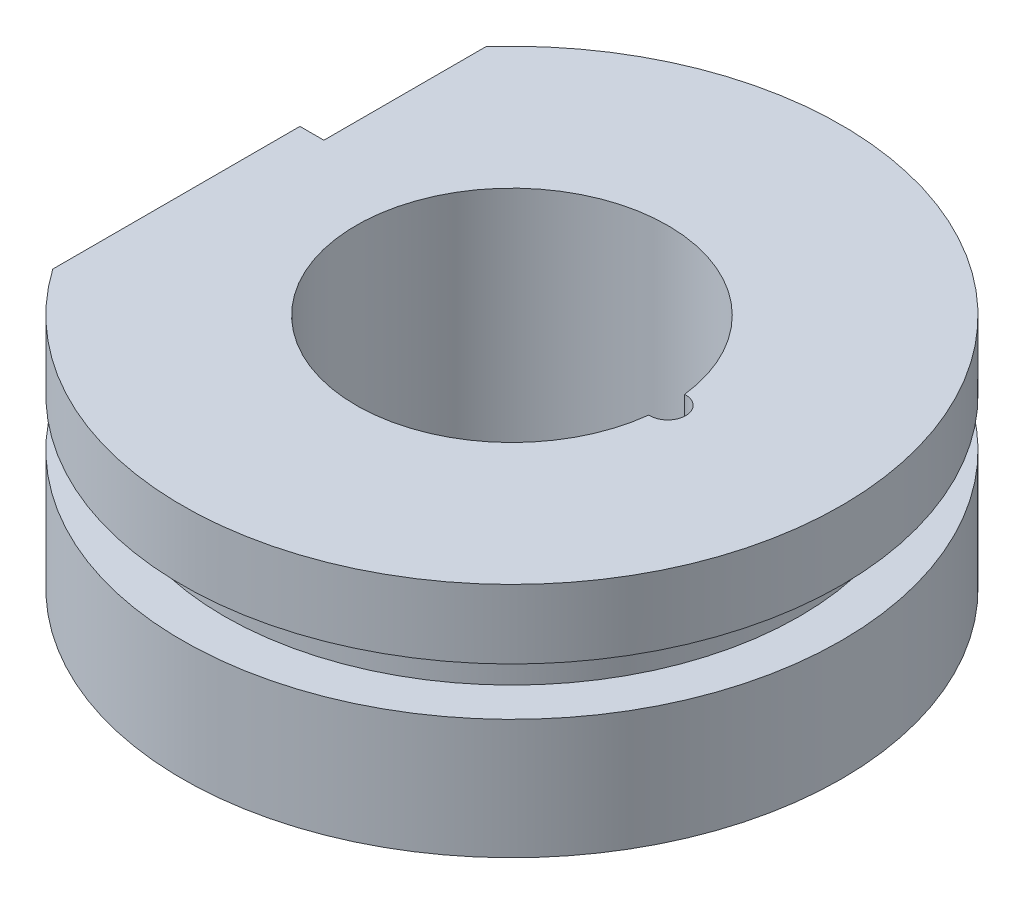
ISO-10303-21;
HEADER;
FILE_DESCRIPTION(('STEP AP214'),'2;1');
FILE_NAME('part.step','',(''),(''),'','','');
FILE_SCHEMA(('AUTOMOTIVE_DESIGN { 1 0 10303 214 1 1 1 1 }'));
ENDSEC;
DATA;
#1=APPLICATION_CONTEXT('core data for automotive mechanical design processes');
#2=APPLICATION_PROTOCOL_DEFINITION('international standard','automotive_design',2000,#1);
#3=PRODUCT_CONTEXT('',#1,'mechanical');
#4=PRODUCT('Part','Part','',(#3));
#5=PRODUCT_RELATED_PRODUCT_CATEGORY('part','',(#4));
#6=PRODUCT_DEFINITION_FORMATION('','',#4);
#7=PRODUCT_DEFINITION_CONTEXT('part definition',#1,'design');
#8=PRODUCT_DEFINITION('design','',#6,#7);
#9=PRODUCT_DEFINITION_SHAPE('','',#8);
#10=(LENGTH_UNIT() NAMED_UNIT(*) SI_UNIT(.MILLI.,.METRE.));
#11=(NAMED_UNIT(*) PLANE_ANGLE_UNIT() SI_UNIT($,.RADIAN.));
#12=(NAMED_UNIT(*) SI_UNIT($,.STERADIAN.) SOLID_ANGLE_UNIT());
#13=UNCERTAINTY_MEASURE_WITH_UNIT(LENGTH_MEASURE(1.E-05),#10,'distance_accuracy_value','');
#14=(GEOMETRIC_REPRESENTATION_CONTEXT(3) GLOBAL_UNCERTAINTY_ASSIGNED_CONTEXT((#13)) GLOBAL_UNIT_ASSIGNED_CONTEXT((#10,
#11,#12)) REPRESENTATION_CONTEXT('',''));
#15=CARTESIAN_POINT('',(0.,0.,0.));
#16=DIRECTION('',(0.,0.,1.));
#17=DIRECTION('',(1.,0.,0.));
#18=AXIS2_PLACEMENT_3D('',#15,#16,#17);
#19=CARTESIAN_POINT('',(0.,19.75,0.));
#20=DIRECTION('',(0.,1.,0.));
#21=DIRECTION('',(0.,0.,1.));
#22=AXIS2_PLACEMENT_3D('',#19,#20,#21);
#23=PLANE('',#22);
#24=DIRECTION('',(0.,0.,1.));
#25=VECTOR('',#24,1.);
#26=CARTESIAN_POINT('',(-20.5,19.75,-27.5));
#27=LINE('',#26,#25);
#28=CARTESIAN_POINT('',(-20.5,19.75,-18.3303027798234));
#29=VERTEX_POINT('',#28);
#30=CARTESIAN_POINT('',(-20.5,19.75,-4.81));
#31=VERTEX_POINT('',#30);
#32=EDGE_CURVE('E111',#29,#31,#27,.T.);
#33=ORIENTED_EDGE('',*,*,#32,.T.);
#34=DIRECTION('',(-1.,0.,0.));
#35=VECTOR('',#34,1.);
#36=CARTESIAN_POINT('',(-22.5,19.75,-4.81));
#37=LINE('',#36,#35);
#38=CARTESIAN_POINT('',(-22.5,19.75,-4.81));
#39=VERTEX_POINT('',#38);
#40=EDGE_CURVE('E114',#31,#39,#37,.T.);
#41=ORIENTED_EDGE('',*,*,#40,.T.);
#42=DIRECTION('',(0.,0.,1.));
#43=VECTOR('',#42,1.);
#44=CARTESIAN_POINT('',(-22.5,19.75,-15.8113883008419));
#45=LINE('',#44,#43);
#46=CARTESIAN_POINT('',(-22.5,19.75,15.8113883008419));
#47=VERTEX_POINT('',#46);
#48=EDGE_CURVE('E152',#39,#47,#45,.T.);
#49=ORIENTED_EDGE('',*,*,#48,.T.);
#50=CARTESIAN_POINT('',(0.,19.75,0.));
#51=DIRECTION('',(0.,1.,0.));
#52=DIRECTION('',(0.,0.,1.));
#53=AXIS2_PLACEMENT_3D('',#50,#51,#52);
#54=CIRCLE('',#53,27.5);
#55=EDGE_CURVE('E125',#47,#29,#54,.T.);
#56=ORIENTED_EDGE('',*,*,#55,.T.);
#57=EDGE_LOOP('',(#33,#41,#49,#56));
#58=FACE_BOUND('',#57,.T.);
#59=CARTESIAN_POINT('',(0.,19.75,0.));
#60=DIRECTION('',(0.,1.,0.));
#61=DIRECTION('',(0.,0.,1.));
#62=AXIS2_PLACEMENT_3D('',#59,#60,#61);
#63=CIRCLE('',#62,13.);
#64=CARTESIAN_POINT('',(12.9134615384615,19.75,-1.49750161758662));
#65=VERTEX_POINT('',#64);
#66=CARTESIAN_POINT('',(12.9134615384615,19.75,1.49750161758662));
#67=VERTEX_POINT('',#66);
#68=EDGE_CURVE('E145',#65,#67,#63,.T.);
#69=ORIENTED_EDGE('',*,*,#68,.F.);
#70=CARTESIAN_POINT('',(13.,19.75,0.));
#71=DIRECTION('',(0.,1.,0.));
#72=DIRECTION('',(0.,0.,1.));
#73=AXIS2_PLACEMENT_3D('',#70,#71,#72);
#74=CIRCLE('',#73,1.5);
#75=EDGE_CURVE('E57',#67,#65,#74,.T.);
#76=ORIENTED_EDGE('',*,*,#75,.F.);
#77=EDGE_LOOP('',(#69,#76));
#78=FACE_BOUND('',#77,.T.);
#79=ADVANCED_FACE('F34',(#58,#78),#23,.T.);
#80=CARTESIAN_POINT('',(0.,0.,0.));
#81=DIRECTION('',(0.,1.,0.));
#82=DIRECTION('',(0.,0.,1.));
#83=AXIS2_PLACEMENT_3D('',#80,#81,#82);
#84=PLANE('',#83);
#85=CARTESIAN_POINT('',(0.,0.,0.));
#86=DIRECTION('',(0.,1.,0.));
#87=DIRECTION('',(0.,0.,1.));
#88=AXIS2_PLACEMENT_3D('',#85,#86,#87);
#89=CIRCLE('',#88,27.5);
#90=CARTESIAN_POINT('',(-22.5,0.,15.8113883008419));
#91=VERTEX_POINT('',#90);
#92=CARTESIAN_POINT('',(-22.5,0.,-15.8113883008419));
#93=VERTEX_POINT('',#92);
#94=EDGE_CURVE('E148',#91,#93,#89,.T.);
#95=ORIENTED_EDGE('',*,*,#94,.F.);
#96=DIRECTION('',(0.,0.,1.));
#97=VECTOR('',#96,1.);
#98=CARTESIAN_POINT('',(-22.5,0.,-15.8113883008419));
#99=LINE('',#98,#97);
#100=EDGE_CURVE('E153',#93,#91,#99,.T.);
#101=ORIENTED_EDGE('',*,*,#100,.F.);
#102=EDGE_LOOP('',(#95,#101));
#103=FACE_BOUND('',#102,.T.);
#104=CARTESIAN_POINT('',(13.,0.,0.));
#105=DIRECTION('',(0.,1.,0.));
#106=DIRECTION('',(0.,0.,1.));
#107=AXIS2_PLACEMENT_3D('',#104,#105,#106);
#108=CIRCLE('',#107,1.5);
#109=CARTESIAN_POINT('',(12.9134615384615,0.,1.49750161758662));
#110=VERTEX_POINT('',#109);
#111=CARTESIAN_POINT('',(12.9134615384615,0.,-1.49750161758662));
#112=VERTEX_POINT('',#111);
#113=EDGE_CURVE('E128',#110,#112,#108,.T.);
#114=ORIENTED_EDGE('',*,*,#113,.T.);
#115=CARTESIAN_POINT('',(0.,0.,0.));
#116=DIRECTION('',(0.,1.,0.));
#117=DIRECTION('',(0.,0.,1.));
#118=AXIS2_PLACEMENT_3D('',#115,#116,#117);
#119=CIRCLE('',#118,13.);
#120=EDGE_CURVE('E144',#112,#110,#119,.T.);
#121=ORIENTED_EDGE('',*,*,#120,.T.);
#122=EDGE_LOOP('',(#114,#121));
#123=FACE_BOUND('',#122,.T.);
#124=ADVANCED_FACE('F185',(#103,#123),#84,.F.);
#125=CARTESIAN_POINT('',(0.,19.75,0.));
#126=DIRECTION('',(0.,-1.,0.));
#127=DIRECTION('',(0.,0.,-1.));
#128=AXIS2_PLACEMENT_3D('',#125,#126,#127);
#129=CYLINDRICAL_SURFACE('',#128,13.);
#130=ORIENTED_EDGE('',*,*,#68,.T.);
#131=DIRECTION('',(0.,-1.,0.));
#132=VECTOR('',#131,1.);
#133=CARTESIAN_POINT('',(12.9134615384615,9.875,1.49750161758662));
#134=LINE('',#133,#132);
#135=EDGE_CURVE('E42',#67,#110,#134,.T.);
#136=ORIENTED_EDGE('',*,*,#135,.T.);
#137=ORIENTED_EDGE('',*,*,#120,.F.);
#138=DIRECTION('',(0.,-1.,0.));
#139=VECTOR('',#138,1.);
#140=CARTESIAN_POINT('',(12.9134615384615,9.875,-1.49750161758662));
#141=LINE('',#140,#139);
#142=EDGE_CURVE('E178',#112,#65,#141,.F.);
#143=ORIENTED_EDGE('',*,*,#142,.T.);
#144=EDGE_LOOP('',(#130,#136,#137,#143));
#145=FACE_BOUND('',#144,.T.);
#146=ADVANCED_FACE('F182',(#145),#129,.F.);
#147=CARTESIAN_POINT('',(0.,19.75,0.));
#148=DIRECTION('',(0.,-1.,0.));
#149=DIRECTION('',(0.,0.,-1.));
#150=AXIS2_PLACEMENT_3D('',#147,#148,#149);
#151=CYLINDRICAL_SURFACE('',#150,27.5);
#152=CARTESIAN_POINT('',(0.,10.,0.));
#153=DIRECTION('',(0.,1.,0.));
#154=DIRECTION('',(0.,0.,1.));
#155=AXIS2_PLACEMENT_3D('',#152,#153,#154);
#156=CIRCLE('',#155,27.5);
#157=CARTESIAN_POINT('',(-22.5,10.,15.8113883008419));
#158=VERTEX_POINT('',#157);
#159=CARTESIAN_POINT('',(-22.5,10.,-15.8113883008419));
#160=VERTEX_POINT('',#159);
#161=EDGE_CURVE('E142',#158,#160,#156,.T.);
#162=ORIENTED_EDGE('',*,*,#161,.F.);
#163=DIRECTION('',(0.,-1.,0.));
#164=VECTOR('',#163,1.);
#165=CARTESIAN_POINT('',(-22.5,19.75,15.8113883008419));
#166=LINE('',#165,#164);
#167=EDGE_CURVE('E155',#158,#91,#166,.T.);
#168=ORIENTED_EDGE('',*,*,#167,.T.);
#169=ORIENTED_EDGE('',*,*,#94,.T.);
#170=DIRECTION('',(0.,-1.,0.));
#171=VECTOR('',#170,1.);
#172=CARTESIAN_POINT('',(-22.5,19.75,-15.8113883008419));
#173=LINE('',#172,#171);
#174=EDGE_CURVE('E163',#160,#93,#173,.T.);
#175=ORIENTED_EDGE('',*,*,#174,.F.);
#176=EDGE_LOOP('',(#162,#168,#169,#175));
#177=FACE_BOUND('',#176,.T.);
#178=ADVANCED_FACE('F36',(#177),#151,.T.);
#179=CARTESIAN_POINT('',(-22.5,17.75,-15.8113883008419));
#180=VERTEX_POINT('',#179);
#181=CARTESIAN_POINT('',(-22.5,14.,-15.8113883008419));
#182=VERTEX_POINT('',#181);
#183=EDGE_CURVE('E164',#180,#182,#173,.T.);
#184=ORIENTED_EDGE('',*,*,#183,.F.);
#185=CARTESIAN_POINT('',(0.,40.25,0.));
#186=DIRECTION('',(0.707106781186547,-0.707106781186548,0.));
#187=DIRECTION('',(-0.707106781186548,-0.707106781186547,0.));
#188=AXIS2_PLACEMENT_3D('',#185,#186,#187);
#189=ELLIPSE('',#188,38.8908729652601,27.5);
#190=EDGE_CURVE('E126',#180,#29,#189,.T.);
#191=ORIENTED_EDGE('',*,*,#190,.T.);
#192=ORIENTED_EDGE('',*,*,#55,.F.);
#193=CARTESIAN_POINT('',(-22.5,14.,15.8113883008419));
#194=VERTEX_POINT('',#193);
#195=EDGE_CURVE('E160',#47,#194,#166,.T.);
#196=ORIENTED_EDGE('',*,*,#195,.T.);
#197=CARTESIAN_POINT('',(0.,14.,0.));
#198=DIRECTION('',(0.,-1.,0.));
#199=DIRECTION('',(0.,0.,-1.));
#200=AXIS2_PLACEMENT_3D('',#197,#198,#199);
#201=CIRCLE('',#200,27.5);
#202=EDGE_CURVE('E140',#182,#194,#201,.T.);
#203=ORIENTED_EDGE('',*,*,#202,.F.);
#204=EDGE_LOOP('',(#184,#191,#192,#196,#203));
#205=FACE_BOUND('',#204,.T.);
#206=ADVANCED_FACE('F199',(#205),#151,.T.);
#207=CARTESIAN_POINT('',(-22.5,19.75,-15.8113883008419));
#208=DIRECTION('',(1.,0.,0.));
#209=DIRECTION('',(0.,0.,-1.));
#210=AXIS2_PLACEMENT_3D('',#207,#208,#209);
#211=PLANE('',#210);
#212=DIRECTION('',(0.,-1.,0.));
#213=VECTOR('',#212,1.);
#214=CARTESIAN_POINT('',(-22.5,17.75,-4.81));
#215=LINE('',#214,#213);
#216=CARTESIAN_POINT('',(-22.5,17.75,-4.81));
#217=VERTEX_POINT('',#216);
#218=EDGE_CURVE('E115',#39,#217,#215,.T.);
#219=ORIENTED_EDGE('',*,*,#218,.T.);
#220=DIRECTION('',(0.,0.,-1.));
#221=VECTOR('',#220,1.);
#222=CARTESIAN_POINT('',(-22.5,17.75,-15.8113883008419));
#223=LINE('',#222,#221);
#224=EDGE_CURVE('E11',#217,#180,#223,.T.);
#225=ORIENTED_EDGE('',*,*,#224,.T.);
#226=ORIENTED_EDGE('',*,*,#183,.T.);
#227=DIRECTION('',(0.,0.,-1.));
#228=VECTOR('',#227,1.);
#229=CARTESIAN_POINT('',(-22.5,14.,-15.8113883008419));
#230=LINE('',#229,#228);
#231=CARTESIAN_POINT('',(-22.5,14.,-8.35164654424504));
#232=VERTEX_POINT('',#231);
#233=EDGE_CURVE('E166',#232,#182,#230,.T.);
#234=ORIENTED_EDGE('',*,*,#233,.F.);
#235=DIRECTION('',(0.,-1.,0.));
#236=VECTOR('',#235,1.);
#237=CARTESIAN_POINT('',(-22.5,0.,-8.35164654424504));
#238=LINE('',#237,#236);
#239=CARTESIAN_POINT('',(-22.5,10.,-8.35164654424504));
#240=VERTEX_POINT('',#239);
#241=EDGE_CURVE('E169',#240,#232,#238,.F.);
#242=ORIENTED_EDGE('',*,*,#241,.F.);
#243=DIRECTION('',(0.,0.,1.));
#244=VECTOR('',#243,1.);
#245=CARTESIAN_POINT('',(-22.5,10.,-15.8113883008419));
#246=LINE('',#245,#244);
#247=EDGE_CURVE('E173',#160,#240,#246,.T.);
#248=ORIENTED_EDGE('',*,*,#247,.F.);
#249=ORIENTED_EDGE('',*,*,#174,.T.);
#250=ORIENTED_EDGE('',*,*,#100,.T.);
#251=ORIENTED_EDGE('',*,*,#167,.F.);
#252=CARTESIAN_POINT('',(-22.5,10.,8.35164654424504));
#253=VERTEX_POINT('',#252);
#254=EDGE_CURVE('E175',#253,#158,#246,.T.);
#255=ORIENTED_EDGE('',*,*,#254,.F.);
#256=DIRECTION('',(0.,-1.,0.));
#257=VECTOR('',#256,1.);
#258=CARTESIAN_POINT('',(-22.5,0.,8.35164654424504));
#259=LINE('',#258,#257);
#260=CARTESIAN_POINT('',(-22.5,14.,8.35164654424504));
#261=VERTEX_POINT('',#260);
#262=EDGE_CURVE('E176',#261,#253,#259,.T.);
#263=ORIENTED_EDGE('',*,*,#262,.F.);
#264=EDGE_CURVE('E170',#194,#261,#230,.T.);
#265=ORIENTED_EDGE('',*,*,#264,.F.);
#266=ORIENTED_EDGE('',*,*,#195,.F.);
#267=ORIENTED_EDGE('',*,*,#48,.F.);
#268=EDGE_LOOP('',(#219,#225,#226,#234,#242,#248,#249,#250,#251,#255,#263,#265,#266,#267));
#269=FACE_BOUND('',#268,.T.);
#270=ADVANCED_FACE('F196',(#269),#211,.F.);
#271=CARTESIAN_POINT('',(0.,10.,29.));
#272=DIRECTION('',(0.,1.,0.));
#273=DIRECTION('',(0.,0.,1.));
#274=AXIS2_PLACEMENT_3D('',#271,#272,#273);
#275=PLANE('',#274);
#276=ORIENTED_EDGE('',*,*,#247,.T.);
#277=CARTESIAN_POINT('',(0.,10.,0.));
#278=DIRECTION('',(0.,-1.,0.));
#279=DIRECTION('',(0.,0.,-1.));
#280=AXIS2_PLACEMENT_3D('',#277,#278,#279);
#281=CIRCLE('',#280,24.);
#282=EDGE_CURVE('E137',#240,#253,#281,.T.);
#283=ORIENTED_EDGE('',*,*,#282,.T.);
#284=ORIENTED_EDGE('',*,*,#254,.T.);
#285=ORIENTED_EDGE('',*,*,#161,.T.);
#286=EDGE_LOOP('',(#276,#283,#284,#285));
#287=FACE_BOUND('',#286,.T.);
#288=ADVANCED_FACE('F198',(#287),#275,.T.);
#289=CARTESIAN_POINT('',(0.,0.,0.));
#290=DIRECTION('',(0.,-1.,0.));
#291=DIRECTION('',(0.,0.,-1.));
#292=AXIS2_PLACEMENT_3D('',#289,#290,#291);
#293=CYLINDRICAL_SURFACE('',#292,24.);
#294=ORIENTED_EDGE('',*,*,#262,.T.);
#295=ORIENTED_EDGE('',*,*,#282,.F.);
#296=ORIENTED_EDGE('',*,*,#241,.T.);
#297=CARTESIAN_POINT('',(0.,14.,0.));
#298=DIRECTION('',(0.,-1.,0.));
#299=DIRECTION('',(0.,0.,-1.));
#300=AXIS2_PLACEMENT_3D('',#297,#298,#299);
#301=CIRCLE('',#300,24.);
#302=EDGE_CURVE('E132',#232,#261,#301,.T.);
#303=ORIENTED_EDGE('',*,*,#302,.T.);
#304=EDGE_LOOP('',(#294,#295,#296,#303));
#305=FACE_BOUND('',#304,.T.);
#306=ADVANCED_FACE('F205',(#305),#293,.T.);
#307=CARTESIAN_POINT('',(0.,14.,29.));
#308=DIRECTION('',(0.,-1.,0.));
#309=DIRECTION('',(0.,0.,-1.));
#310=AXIS2_PLACEMENT_3D('',#307,#308,#309);
#311=PLANE('',#310);
#312=ORIENTED_EDGE('',*,*,#264,.T.);
#313=ORIENTED_EDGE('',*,*,#302,.F.);
#314=ORIENTED_EDGE('',*,*,#233,.T.);
#315=ORIENTED_EDGE('',*,*,#202,.T.);
#316=EDGE_LOOP('',(#312,#313,#314,#315));
#317=FACE_BOUND('',#316,.T.);
#318=ADVANCED_FACE('F217',(#317),#311,.T.);
#319=CARTESIAN_POINT('',(13.,19.75,0.));
#320=DIRECTION('',(0.,-1.,0.));
#321=DIRECTION('',(0.,0.,-1.));
#322=AXIS2_PLACEMENT_3D('',#319,#320,#321);
#323=CYLINDRICAL_SURFACE('',#322,1.5);
#324=ORIENTED_EDGE('',*,*,#75,.T.);
#325=ORIENTED_EDGE('',*,*,#142,.F.);
#326=ORIENTED_EDGE('',*,*,#113,.F.);
#327=ORIENTED_EDGE('',*,*,#135,.F.);
#328=EDGE_LOOP('',(#324,#325,#326,#327));
#329=FACE_BOUND('',#328,.T.);
#330=ADVANCED_FACE('F186',(#329),#323,.F.);
#331=CARTESIAN_POINT('',(-20.5,19.75,-27.5));
#332=DIRECTION('',(0.707106781186547,-0.707106781186548,0.));
#333=DIRECTION('',(0.707106781186548,0.707106781186547,0.));
#334=AXIS2_PLACEMENT_3D('',#331,#332,#333);
#335=PLANE('',#334);
#336=ORIENTED_EDGE('',*,*,#224,.F.);
#337=DIRECTION('',(0.707106781186548,0.707106781186547,0.));
#338=VECTOR('',#337,1.);
#339=CARTESIAN_POINT('',(-20.5,19.75,-4.81));
#340=LINE('',#339,#338);
#341=EDGE_CURVE('E49',#217,#31,#340,.T.);
#342=ORIENTED_EDGE('',*,*,#341,.T.);
#343=ORIENTED_EDGE('',*,*,#32,.F.);
#344=ORIENTED_EDGE('',*,*,#190,.F.);
#345=EDGE_LOOP('',(#336,#342,#343,#344));
#346=FACE_BOUND('',#345,.T.);
#347=ADVANCED_FACE('F109',(#346),#335,.F.);
#348=CARTESIAN_POINT('',(0.,0.,-4.81));
#349=DIRECTION('',(0.,0.,-1.));
#350=DIRECTION('',(-1.,0.,0.));
#351=AXIS2_PLACEMENT_3D('',#348,#349,#350);
#352=PLANE('',#351);
#353=ORIENTED_EDGE('',*,*,#218,.F.);
#354=ORIENTED_EDGE('',*,*,#40,.F.);
#355=ORIENTED_EDGE('',*,*,#341,.F.);
#356=EDGE_LOOP('',(#353,#354,#355));
#357=FACE_BOUND('',#356,.T.);
#358=ADVANCED_FACE('F118',(#357),#352,.T.);
#359=CLOSED_SHELL('',(#79,#124,#146,#178,#206,#270,#288,#306,#318,#330,#347,#358));
#360=MANIFOLD_SOLID_BREP('B2',#359);
#361=ADVANCED_BREP_SHAPE_REPRESENTATION('',(#18,#360),#14);
#362=SHAPE_DEFINITION_REPRESENTATION(#9,#361);
ENDSEC;
END-ISO-10303-21;
